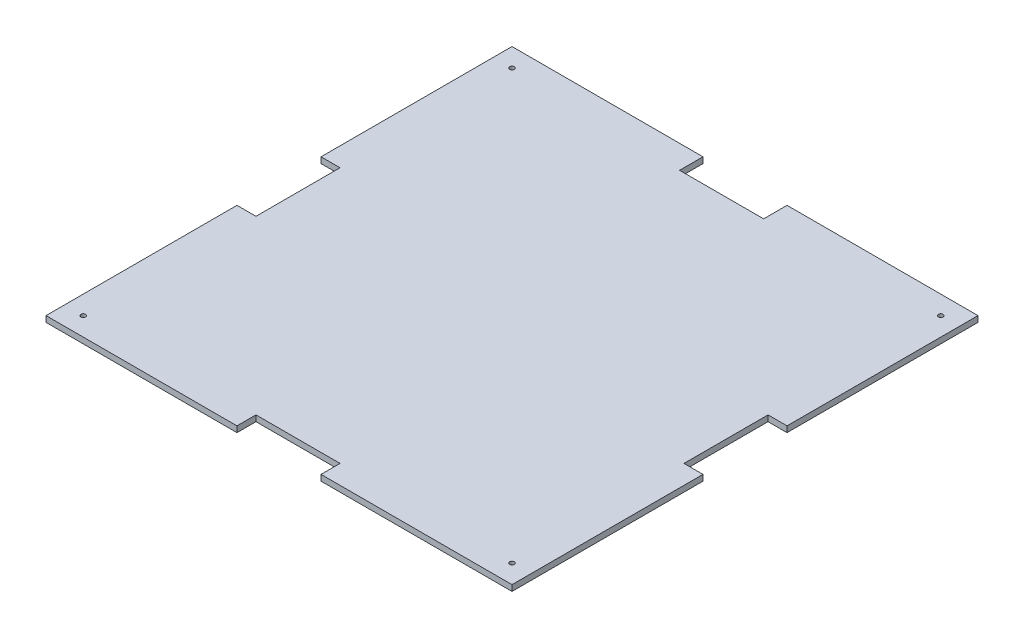
ISO-10303-21;
HEADER;
FILE_DESCRIPTION(('STEP AP214'),'2;1');
FILE_NAME('part.step','',(''),(''),'','','');
FILE_SCHEMA(('AUTOMOTIVE_DESIGN { 1 0 10303 214 1 1 1 1 }'));
ENDSEC;
DATA;
#1=APPLICATION_CONTEXT('core data for automotive mechanical design processes');
#2=APPLICATION_PROTOCOL_DEFINITION('international standard','automotive_design',2000,#1);
#3=PRODUCT_CONTEXT('',#1,'mechanical');
#4=PRODUCT('Part','Part','',(#3));
#5=PRODUCT_RELATED_PRODUCT_CATEGORY('part','',(#4));
#6=PRODUCT_DEFINITION_FORMATION('','',#4);
#7=PRODUCT_DEFINITION_CONTEXT('part definition',#1,'design');
#8=PRODUCT_DEFINITION('design','',#6,#7);
#9=PRODUCT_DEFINITION_SHAPE('','',#8);
#10=(LENGTH_UNIT() NAMED_UNIT(*) SI_UNIT(.MILLI.,.METRE.));
#11=(NAMED_UNIT(*) PLANE_ANGLE_UNIT() SI_UNIT($,.RADIAN.));
#12=(NAMED_UNIT(*) SI_UNIT($,.STERADIAN.) SOLID_ANGLE_UNIT());
#13=UNCERTAINTY_MEASURE_WITH_UNIT(LENGTH_MEASURE(1.E-05),#10,'distance_accuracy_value','');
#14=(GEOMETRIC_REPRESENTATION_CONTEXT(3) GLOBAL_UNCERTAINTY_ASSIGNED_CONTEXT((#13)) GLOBAL_UNIT_ASSIGNED_CONTEXT((#10,
#11,#12)) REPRESENTATION_CONTEXT('',''));
#15=CARTESIAN_POINT('',(0.,0.,0.));
#16=DIRECTION('',(0.,0.,1.));
#17=DIRECTION('',(1.,0.,0.));
#18=AXIS2_PLACEMENT_3D('',#15,#16,#17);
#19=CARTESIAN_POINT('',(0.,3.175,0.));
#20=DIRECTION('',(0.,-1.,0.));
#21=DIRECTION('',(0.,0.,-1.));
#22=AXIS2_PLACEMENT_3D('',#19,#20,#21);
#23=PLANE('',#22);
#24=CARTESIAN_POINT('',(115.,3.175,-115.));
#25=DIRECTION('',(0.,1.,0.));
#26=DIRECTION('',(0.,0.,1.));
#27=AXIS2_PLACEMENT_3D('',#24,#25,#26);
#28=CIRCLE('',#27,1.24999999999999);
#29=CARTESIAN_POINT('',(115.,3.175,-113.75));
#30=VERTEX_POINT('',#29);
#31=EDGE_CURVE('E418',#30,#30,#28,.T.);
#32=ORIENTED_EDGE('',*,*,#31,.F.);
#33=EDGE_LOOP('',(#32));
#34=FACE_BOUND('',#33,.T.);
#35=CARTESIAN_POINT('',(-115.,3.175,115.));
#36=DIRECTION('',(0.,1.,0.));
#37=DIRECTION('',(0.,0.,1.));
#38=AXIS2_PLACEMENT_3D('',#35,#36,#37);
#39=CIRCLE('',#38,1.24999999999999);
#40=CARTESIAN_POINT('',(-115.,3.175,116.25));
#41=VERTEX_POINT('',#40);
#42=EDGE_CURVE('E406',#41,#41,#39,.T.);
#43=ORIENTED_EDGE('',*,*,#42,.F.);
#44=EDGE_LOOP('',(#43));
#45=FACE_BOUND('',#44,.T.);
#46=CARTESIAN_POINT('',(-115.,3.175,-115.));
#47=DIRECTION('',(0.,1.,0.));
#48=DIRECTION('',(0.,0.,1.));
#49=AXIS2_PLACEMENT_3D('',#46,#47,#48);
#50=CIRCLE('',#49,1.24999999999999);
#51=CARTESIAN_POINT('',(-115.,3.175,-113.75));
#52=VERTEX_POINT('',#51);
#53=EDGE_CURVE('E400',#52,#52,#50,.T.);
#54=ORIENTED_EDGE('',*,*,#53,.F.);
#55=EDGE_LOOP('',(#54));
#56=FACE_BOUND('',#55,.T.);
#57=DIRECTION('',(-1.,0.,0.));
#58=VECTOR('',#57,1.);
#59=CARTESIAN_POINT('',(-125.,3.175,-125.));
#60=LINE('',#59,#58);
#61=CARTESIAN_POINT('',(125.,3.175,-125.));
#62=VERTEX_POINT('',#61);
#63=CARTESIAN_POINT('',(22.55,3.175,-125.));
#64=VERTEX_POINT('',#63);
#65=EDGE_CURVE('E262',#62,#64,#60,.T.);
#66=ORIENTED_EDGE('',*,*,#65,.T.);
#67=DIRECTION('',(0.,0.,-1.));
#68=VECTOR('',#67,1.);
#69=CARTESIAN_POINT('',(22.55,3.175,-137.55));
#70=LINE('',#69,#68);
#71=CARTESIAN_POINT('',(22.55,3.175,-112.45));
#72=VERTEX_POINT('',#71);
#73=EDGE_CURVE('E191',#72,#64,#70,.T.);
#74=ORIENTED_EDGE('',*,*,#73,.F.);
#75=DIRECTION('',(1.,0.,0.));
#76=VECTOR('',#75,1.);
#77=CARTESIAN_POINT('',(-22.55,3.175,-112.45));
#78=LINE('',#77,#76);
#79=CARTESIAN_POINT('',(-22.55,3.175,-112.45));
#80=VERTEX_POINT('',#79);
#81=EDGE_CURVE('E178',#80,#72,#78,.T.);
#82=ORIENTED_EDGE('',*,*,#81,.F.);
#83=DIRECTION('',(0.,0.,1.));
#84=VECTOR('',#83,1.);
#85=CARTESIAN_POINT('',(-22.55,3.175,-137.55));
#86=LINE('',#85,#84);
#87=CARTESIAN_POINT('',(-22.55,3.175,-125.));
#88=VERTEX_POINT('',#87);
#89=EDGE_CURVE('E185',#88,#80,#86,.T.);
#90=ORIENTED_EDGE('',*,*,#89,.F.);
#91=CARTESIAN_POINT('',(-125.,3.175,-125.));
#92=VERTEX_POINT('',#91);
#93=EDGE_CURVE('E260',#88,#92,#60,.T.);
#94=ORIENTED_EDGE('',*,*,#93,.T.);
#95=DIRECTION('',(0.,0.,1.));
#96=VECTOR('',#95,1.);
#97=CARTESIAN_POINT('',(-125.,3.175,125.));
#98=LINE('',#97,#96);
#99=CARTESIAN_POINT('',(-125.,3.175,-22.55));
#100=VERTEX_POINT('',#99);
#101=EDGE_CURVE('E265',#92,#100,#98,.T.);
#102=ORIENTED_EDGE('',*,*,#101,.T.);
#103=DIRECTION('',(-1.,0.,0.));
#104=VECTOR('',#103,1.);
#105=CARTESIAN_POINT('',(-114.810543342276,3.175,-22.55));
#106=LINE('',#105,#104);
#107=CARTESIAN_POINT('',(-114.810543342276,3.175,-22.55));
#108=VERTEX_POINT('',#107);
#109=EDGE_CURVE('E206',#108,#100,#106,.T.);
#110=ORIENTED_EDGE('',*,*,#109,.F.);
#111=DIRECTION('',(0.,0.,-1.));
#112=VECTOR('',#111,1.);
#113=CARTESIAN_POINT('',(-114.810543342276,3.175,22.55));
#114=LINE('',#113,#112);
#115=CARTESIAN_POINT('',(-114.810543342276,3.175,22.55));
#116=VERTEX_POINT('',#115);
#117=EDGE_CURVE('E202',#116,#108,#114,.T.);
#118=ORIENTED_EDGE('',*,*,#117,.F.);
#119=DIRECTION('',(1.,0.,0.));
#120=VECTOR('',#119,1.);
#121=CARTESIAN_POINT('',(-114.810543342276,3.175,22.55));
#122=LINE('',#121,#120);
#123=CARTESIAN_POINT('',(-125.,3.175,22.55));
#124=VERTEX_POINT('',#123);
#125=EDGE_CURVE('E200',#124,#116,#122,.T.);
#126=ORIENTED_EDGE('',*,*,#125,.F.);
#127=CARTESIAN_POINT('',(-125.,3.175,125.));
#128=VERTEX_POINT('',#127);
#129=EDGE_CURVE('E264',#124,#128,#98,.T.);
#130=ORIENTED_EDGE('',*,*,#129,.T.);
#131=DIRECTION('',(1.,0.,0.));
#132=VECTOR('',#131,1.);
#133=CARTESIAN_POINT('',(-125.,3.175,125.));
#134=LINE('',#133,#132);
#135=CARTESIAN_POINT('',(-22.55,3.175,125.));
#136=VERTEX_POINT('',#135);
#137=EDGE_CURVE('E269',#128,#136,#134,.T.);
#138=ORIENTED_EDGE('',*,*,#137,.T.);
#139=DIRECTION('',(0.,0.,1.));
#140=VECTOR('',#139,1.);
#141=CARTESIAN_POINT('',(-22.55,3.175,114.810543342276));
#142=LINE('',#141,#140);
#143=CARTESIAN_POINT('',(-22.55,3.175,114.810543342276));
#144=VERTEX_POINT('',#143);
#145=EDGE_CURVE('E223',#144,#136,#142,.T.);
#146=ORIENTED_EDGE('',*,*,#145,.F.);
#147=DIRECTION('',(-1.,0.,0.));
#148=VECTOR('',#147,1.);
#149=CARTESIAN_POINT('',(22.55,3.175,114.810543342276));
#150=LINE('',#149,#148);
#151=CARTESIAN_POINT('',(22.55,3.175,114.810543342276));
#152=VERTEX_POINT('',#151);
#153=EDGE_CURVE('E229',#152,#144,#150,.T.);
#154=ORIENTED_EDGE('',*,*,#153,.F.);
#155=DIRECTION('',(0.,0.,-1.));
#156=VECTOR('',#155,1.);
#157=CARTESIAN_POINT('',(22.55,3.175,114.810543342276));
#158=LINE('',#157,#156);
#159=CARTESIAN_POINT('',(22.55,3.175,125.));
#160=VERTEX_POINT('',#159);
#161=EDGE_CURVE('E225',#160,#152,#158,.T.);
#162=ORIENTED_EDGE('',*,*,#161,.F.);
#163=CARTESIAN_POINT('',(125.,3.175,125.));
#164=VERTEX_POINT('',#163);
#165=EDGE_CURVE('E268',#160,#164,#134,.T.);
#166=ORIENTED_EDGE('',*,*,#165,.T.);
#167=DIRECTION('',(0.,0.,-1.));
#168=VECTOR('',#167,1.);
#169=CARTESIAN_POINT('',(125.,3.175,125.));
#170=LINE('',#169,#168);
#171=CARTESIAN_POINT('',(125.,3.175,22.55));
#172=VERTEX_POINT('',#171);
#173=EDGE_CURVE('E257',#164,#172,#170,.T.);
#174=ORIENTED_EDGE('',*,*,#173,.T.);
#175=DIRECTION('',(1.,0.,0.));
#176=VECTOR('',#175,1.);
#177=CARTESIAN_POINT('',(114.810543342276,3.175,22.55));
#178=LINE('',#177,#176);
#179=CARTESIAN_POINT('',(114.810543342276,3.175,22.55));
#180=VERTEX_POINT('',#179);
#181=EDGE_CURVE('E218',#180,#172,#178,.T.);
#182=ORIENTED_EDGE('',*,*,#181,.F.);
#183=DIRECTION('',(0.,0.,1.));
#184=VECTOR('',#183,1.);
#185=CARTESIAN_POINT('',(114.810543342276,3.175,22.55));
#186=LINE('',#185,#184);
#187=CARTESIAN_POINT('',(114.810543342276,3.175,-22.55));
#188=VERTEX_POINT('',#187);
#189=EDGE_CURVE('E214',#188,#180,#186,.T.);
#190=ORIENTED_EDGE('',*,*,#189,.F.);
#191=DIRECTION('',(-1.,0.,0.));
#192=VECTOR('',#191,1.);
#193=CARTESIAN_POINT('',(114.810543342276,3.175,-22.55));
#194=LINE('',#193,#192);
#195=CARTESIAN_POINT('',(125.,3.175,-22.55));
#196=VERTEX_POINT('',#195);
#197=EDGE_CURVE('E211',#196,#188,#194,.T.);
#198=ORIENTED_EDGE('',*,*,#197,.F.);
#199=EDGE_CURVE('E261',#196,#62,#170,.T.);
#200=ORIENTED_EDGE('',*,*,#199,.T.);
#201=EDGE_LOOP('',(#66,#74,#82,#90,#94,#102,#110,#118,#126,#130,#138,#146,#154,#162,#166,#174,
#182,#190,#198,#200));
#202=FACE_BOUND('',#201,.T.);
#203=CARTESIAN_POINT('',(115.,3.175,115.));
#204=DIRECTION('',(0.,1.,0.));
#205=DIRECTION('',(0.,0.,1.));
#206=AXIS2_PLACEMENT_3D('',#203,#204,#205);
#207=CIRCLE('',#206,1.24999999999999);
#208=CARTESIAN_POINT('',(115.,3.175,116.25));
#209=VERTEX_POINT('',#208);
#210=EDGE_CURVE('E412',#209,#209,#207,.T.);
#211=ORIENTED_EDGE('',*,*,#210,.F.);
#212=EDGE_LOOP('',(#211));
#213=FACE_BOUND('',#212,.T.);
#214=ADVANCED_FACE('F40',(#34,#45,#56,#202,#213),#23,.F.);
#215=CARTESIAN_POINT('',(125.,3.175,125.));
#216=DIRECTION('',(-1.,0.,0.));
#217=DIRECTION('',(0.,0.,1.));
#218=AXIS2_PLACEMENT_3D('',#215,#216,#217);
#219=PLANE('',#218);
#220=DIRECTION('',(0.,0.,-1.));
#221=VECTOR('',#220,1.);
#222=CARTESIAN_POINT('',(125.,0.,125.));
#223=LINE('',#222,#221);
#224=CARTESIAN_POINT('',(125.,0.,125.));
#225=VERTEX_POINT('',#224);
#226=CARTESIAN_POINT('',(125.,0.,22.55));
#227=VERTEX_POINT('',#226);
#228=EDGE_CURVE('E273',#225,#227,#223,.T.);
#229=ORIENTED_EDGE('',*,*,#228,.T.);
#230=DIRECTION('',(0.,1.,0.));
#231=VECTOR('',#230,1.);
#232=CARTESIAN_POINT('',(125.,3.175,22.55));
#233=LINE('',#232,#231);
#234=EDGE_CURVE('E243',#227,#172,#233,.T.);
#235=ORIENTED_EDGE('',*,*,#234,.T.);
#236=ORIENTED_EDGE('',*,*,#173,.F.);
#237=DIRECTION('',(0.,-1.,0.));
#238=VECTOR('',#237,1.);
#239=CARTESIAN_POINT('',(125.,3.175,125.));
#240=LINE('',#239,#238);
#241=EDGE_CURVE('E272',#164,#225,#240,.T.);
#242=ORIENTED_EDGE('',*,*,#241,.T.);
#243=EDGE_LOOP('',(#229,#235,#236,#242));
#244=FACE_BOUND('',#243,.T.);
#245=ADVANCED_FACE('F373',(#244),#219,.F.);
#246=CARTESIAN_POINT('',(-125.,3.175,-125.));
#247=DIRECTION('',(0.,0.,1.));
#248=DIRECTION('',(1.,0.,0.));
#249=AXIS2_PLACEMENT_3D('',#246,#247,#248);
#250=PLANE('',#249);
#251=DIRECTION('',(-1.,0.,0.));
#252=VECTOR('',#251,1.);
#253=CARTESIAN_POINT('',(-125.,0.,-125.));
#254=LINE('',#253,#252);
#255=CARTESIAN_POINT('',(125.,0.,-125.));
#256=VERTEX_POINT('',#255);
#257=CARTESIAN_POINT('',(22.55,0.,-125.));
#258=VERTEX_POINT('',#257);
#259=EDGE_CURVE('E277',#256,#258,#254,.T.);
#260=ORIENTED_EDGE('',*,*,#259,.T.);
#261=DIRECTION('',(0.,1.,0.));
#262=VECTOR('',#261,1.);
#263=CARTESIAN_POINT('',(22.55,3.175,-125.));
#264=LINE('',#263,#262);
#265=EDGE_CURVE('E253',#258,#64,#264,.T.);
#266=ORIENTED_EDGE('',*,*,#265,.T.);
#267=ORIENTED_EDGE('',*,*,#65,.F.);
#268=DIRECTION('',(0.,-1.,0.));
#269=VECTOR('',#268,1.);
#270=CARTESIAN_POINT('',(125.,3.175,-125.));
#271=LINE('',#270,#269);
#272=EDGE_CURVE('E296',#62,#256,#271,.T.);
#273=ORIENTED_EDGE('',*,*,#272,.T.);
#274=EDGE_LOOP('',(#260,#266,#267,#273));
#275=FACE_BOUND('',#274,.T.);
#276=ADVANCED_FACE('F394',(#275),#250,.F.);
#277=CARTESIAN_POINT('',(-125.,3.175,125.));
#278=DIRECTION('',(1.,0.,0.));
#279=DIRECTION('',(0.,0.,-1.));
#280=AXIS2_PLACEMENT_3D('',#277,#278,#279);
#281=PLANE('',#280);
#282=DIRECTION('',(0.,0.,1.));
#283=VECTOR('',#282,1.);
#284=CARTESIAN_POINT('',(-125.,0.,125.));
#285=LINE('',#284,#283);
#286=CARTESIAN_POINT('',(-125.,0.,-125.));
#287=VERTEX_POINT('',#286);
#288=CARTESIAN_POINT('',(-125.,0.,-22.55));
#289=VERTEX_POINT('',#288);
#290=EDGE_CURVE('E281',#287,#289,#285,.T.);
#291=ORIENTED_EDGE('',*,*,#290,.T.);
#292=DIRECTION('',(0.,1.,0.));
#293=VECTOR('',#292,1.);
#294=CARTESIAN_POINT('',(-125.,3.175,-22.55));
#295=LINE('',#294,#293);
#296=EDGE_CURVE('E249',#289,#100,#295,.T.);
#297=ORIENTED_EDGE('',*,*,#296,.T.);
#298=ORIENTED_EDGE('',*,*,#101,.F.);
#299=DIRECTION('',(0.,-1.,0.));
#300=VECTOR('',#299,1.);
#301=CARTESIAN_POINT('',(-125.,3.175,-125.));
#302=LINE('',#301,#300);
#303=EDGE_CURVE('E293',#92,#287,#302,.T.);
#304=ORIENTED_EDGE('',*,*,#303,.T.);
#305=EDGE_LOOP('',(#291,#297,#298,#304));
#306=FACE_BOUND('',#305,.T.);
#307=ADVANCED_FACE('F331',(#306),#281,.F.);
#308=CARTESIAN_POINT('',(-125.,3.175,125.));
#309=DIRECTION('',(0.,0.,-1.));
#310=DIRECTION('',(-1.,0.,0.));
#311=AXIS2_PLACEMENT_3D('',#308,#309,#310);
#312=PLANE('',#311);
#313=DIRECTION('',(1.,0.,0.));
#314=VECTOR('',#313,1.);
#315=CARTESIAN_POINT('',(-125.,0.,125.));
#316=LINE('',#315,#314);
#317=CARTESIAN_POINT('',(-125.,0.,125.));
#318=VERTEX_POINT('',#317);
#319=CARTESIAN_POINT('',(-22.55,0.,125.));
#320=VERTEX_POINT('',#319);
#321=EDGE_CURVE('E285',#318,#320,#316,.T.);
#322=ORIENTED_EDGE('',*,*,#321,.T.);
#323=DIRECTION('',(0.,1.,0.));
#324=VECTOR('',#323,1.);
#325=CARTESIAN_POINT('',(-22.55,3.175,125.));
#326=LINE('',#325,#324);
#327=EDGE_CURVE('E237',#320,#136,#326,.T.);
#328=ORIENTED_EDGE('',*,*,#327,.T.);
#329=ORIENTED_EDGE('',*,*,#137,.F.);
#330=DIRECTION('',(0.,-1.,0.));
#331=VECTOR('',#330,1.);
#332=CARTESIAN_POINT('',(-125.,3.175,125.));
#333=LINE('',#332,#331);
#334=EDGE_CURVE('E290',#128,#318,#333,.T.);
#335=ORIENTED_EDGE('',*,*,#334,.T.);
#336=EDGE_LOOP('',(#322,#328,#329,#335));
#337=FACE_BOUND('',#336,.T.);
#338=ADVANCED_FACE('F351',(#337),#312,.F.);
#339=ORIENTED_EDGE('',*,*,#199,.F.);
#340=DIRECTION('',(0.,-1.,0.));
#341=VECTOR('',#340,1.);
#342=CARTESIAN_POINT('',(125.,3.175,-22.55));
#343=LINE('',#342,#341);
#344=CARTESIAN_POINT('',(125.,0.,-22.55));
#345=VERTEX_POINT('',#344);
#346=EDGE_CURVE('E240',#196,#345,#343,.T.);
#347=ORIENTED_EDGE('',*,*,#346,.T.);
#348=EDGE_CURVE('E256',#345,#256,#223,.T.);
#349=ORIENTED_EDGE('',*,*,#348,.T.);
#350=ORIENTED_EDGE('',*,*,#272,.F.);
#351=EDGE_LOOP('',(#339,#347,#349,#350));
#352=FACE_BOUND('',#351,.T.);
#353=ADVANCED_FACE('F42',(#352),#219,.F.);
#354=ORIENTED_EDGE('',*,*,#93,.F.);
#355=DIRECTION('',(0.,-1.,0.));
#356=VECTOR('',#355,1.);
#357=CARTESIAN_POINT('',(-22.55,3.175,-125.));
#358=LINE('',#357,#356);
#359=CARTESIAN_POINT('',(-22.55,0.,-125.));
#360=VERTEX_POINT('',#359);
#361=EDGE_CURVE('E188',#88,#360,#358,.T.);
#362=ORIENTED_EDGE('',*,*,#361,.T.);
#363=EDGE_CURVE('E276',#360,#287,#254,.T.);
#364=ORIENTED_EDGE('',*,*,#363,.T.);
#365=ORIENTED_EDGE('',*,*,#303,.F.);
#366=EDGE_LOOP('',(#354,#362,#364,#365));
#367=FACE_BOUND('',#366,.T.);
#368=ADVANCED_FACE('F323',(#367),#250,.F.);
#369=ORIENTED_EDGE('',*,*,#129,.F.);
#370=DIRECTION('',(0.,-1.,0.));
#371=VECTOR('',#370,1.);
#372=CARTESIAN_POINT('',(-125.,3.175,22.55));
#373=LINE('',#372,#371);
#374=CARTESIAN_POINT('',(-125.,0.,22.55));
#375=VERTEX_POINT('',#374);
#376=EDGE_CURVE('E246',#124,#375,#373,.T.);
#377=ORIENTED_EDGE('',*,*,#376,.T.);
#378=EDGE_CURVE('E280',#375,#318,#285,.T.);
#379=ORIENTED_EDGE('',*,*,#378,.T.);
#380=ORIENTED_EDGE('',*,*,#334,.F.);
#381=EDGE_LOOP('',(#369,#377,#379,#380));
#382=FACE_BOUND('',#381,.T.);
#383=ADVANCED_FACE('F346',(#382),#281,.F.);
#384=ORIENTED_EDGE('',*,*,#165,.F.);
#385=DIRECTION('',(0.,-1.,0.));
#386=VECTOR('',#385,1.);
#387=CARTESIAN_POINT('',(22.55,3.175,125.));
#388=LINE('',#387,#386);
#389=CARTESIAN_POINT('',(22.55,0.,125.));
#390=VERTEX_POINT('',#389);
#391=EDGE_CURVE('E198',#160,#390,#388,.T.);
#392=ORIENTED_EDGE('',*,*,#391,.T.);
#393=EDGE_CURVE('E284',#390,#225,#316,.T.);
#394=ORIENTED_EDGE('',*,*,#393,.T.);
#395=ORIENTED_EDGE('',*,*,#241,.F.);
#396=EDGE_LOOP('',(#384,#392,#394,#395));
#397=FACE_BOUND('',#396,.T.);
#398=ADVANCED_FACE('F368',(#397),#312,.F.);
#399=CARTESIAN_POINT('',(0.,0.,0.));
#400=DIRECTION('',(0.,-1.,0.));
#401=DIRECTION('',(0.,0.,-1.));
#402=AXIS2_PLACEMENT_3D('',#399,#400,#401);
#403=PLANE('',#402);
#404=CARTESIAN_POINT('',(115.,0.,-115.));
#405=DIRECTION('',(0.,1.,0.));
#406=DIRECTION('',(0.,0.,1.));
#407=AXIS2_PLACEMENT_3D('',#404,#405,#406);
#408=CIRCLE('',#407,1.25);
#409=CARTESIAN_POINT('',(115.,0.,-113.75));
#410=VERTEX_POINT('',#409);
#411=EDGE_CURVE('E415',#410,#410,#408,.T.);
#412=ORIENTED_EDGE('',*,*,#411,.T.);
#413=EDGE_LOOP('',(#412));
#414=FACE_BOUND('',#413,.T.);
#415=CARTESIAN_POINT('',(115.,0.,115.));
#416=DIRECTION('',(0.,1.,0.));
#417=DIRECTION('',(0.,0.,1.));
#418=AXIS2_PLACEMENT_3D('',#415,#416,#417);
#419=CIRCLE('',#418,1.25);
#420=CARTESIAN_POINT('',(115.,0.,116.25));
#421=VERTEX_POINT('',#420);
#422=EDGE_CURVE('E409',#421,#421,#419,.T.);
#423=ORIENTED_EDGE('',*,*,#422,.T.);
#424=EDGE_LOOP('',(#423));
#425=FACE_BOUND('',#424,.T.);
#426=CARTESIAN_POINT('',(-115.,0.,115.));
#427=DIRECTION('',(0.,1.,0.));
#428=DIRECTION('',(0.,0.,1.));
#429=AXIS2_PLACEMENT_3D('',#426,#427,#428);
#430=CIRCLE('',#429,1.25);
#431=CARTESIAN_POINT('',(-115.,0.,116.25));
#432=VERTEX_POINT('',#431);
#433=EDGE_CURVE('E403',#432,#432,#430,.T.);
#434=ORIENTED_EDGE('',*,*,#433,.T.);
#435=EDGE_LOOP('',(#434));
#436=FACE_BOUND('',#435,.T.);
#437=CARTESIAN_POINT('',(-115.,0.,-115.));
#438=DIRECTION('',(0.,1.,0.));
#439=DIRECTION('',(0.,0.,1.));
#440=AXIS2_PLACEMENT_3D('',#437,#438,#439);
#441=CIRCLE('',#440,1.25);
#442=CARTESIAN_POINT('',(-115.,0.,-113.75));
#443=VERTEX_POINT('',#442);
#444=EDGE_CURVE('E226',#443,#443,#441,.T.);
#445=ORIENTED_EDGE('',*,*,#444,.T.);
#446=EDGE_LOOP('',(#445));
#447=FACE_BOUND('',#446,.T.);
#448=DIRECTION('',(0.,0.,1.));
#449=VECTOR('',#448,1.);
#450=CARTESIAN_POINT('',(22.55,0.,0.));
#451=LINE('',#450,#449);
#452=CARTESIAN_POINT('',(22.55,0.,-112.45));
#453=VERTEX_POINT('',#452);
#454=EDGE_CURVE('E11',#258,#453,#451,.T.);
#455=ORIENTED_EDGE('',*,*,#454,.F.);
#456=ORIENTED_EDGE('',*,*,#259,.F.);
#457=ORIENTED_EDGE('',*,*,#348,.F.);
#458=DIRECTION('',(1.,0.,0.));
#459=VECTOR('',#458,1.);
#460=CARTESIAN_POINT('',(0.,0.,-22.55));
#461=LINE('',#460,#459);
#462=CARTESIAN_POINT('',(114.810543342276,0.,-22.55));
#463=VERTEX_POINT('',#462);
#464=EDGE_CURVE('E306',#463,#345,#461,.T.);
#465=ORIENTED_EDGE('',*,*,#464,.F.);
#466=DIRECTION('',(0.,0.,-1.));
#467=VECTOR('',#466,1.);
#468=CARTESIAN_POINT('',(114.810543342276,0.,0.));
#469=LINE('',#468,#467);
#470=CARTESIAN_POINT('',(114.810543342276,0.,22.55));
#471=VERTEX_POINT('',#470);
#472=EDGE_CURVE('E308',#471,#463,#469,.T.);
#473=ORIENTED_EDGE('',*,*,#472,.F.);
#474=DIRECTION('',(-1.,0.,0.));
#475=VECTOR('',#474,1.);
#476=CARTESIAN_POINT('',(0.,0.,22.55));
#477=LINE('',#476,#475);
#478=EDGE_CURVE('E311',#227,#471,#477,.T.);
#479=ORIENTED_EDGE('',*,*,#478,.F.);
#480=ORIENTED_EDGE('',*,*,#228,.F.);
#481=ORIENTED_EDGE('',*,*,#393,.F.);
#482=DIRECTION('',(0.,0.,1.));
#483=VECTOR('',#482,1.);
#484=CARTESIAN_POINT('',(22.55,0.,0.));
#485=LINE('',#484,#483);
#486=CARTESIAN_POINT('',(22.55,0.,114.810543342276));
#487=VERTEX_POINT('',#486);
#488=EDGE_CURVE('E299',#487,#390,#485,.T.);
#489=ORIENTED_EDGE('',*,*,#488,.F.);
#490=DIRECTION('',(1.,0.,0.));
#491=VECTOR('',#490,1.);
#492=CARTESIAN_POINT('',(0.,0.,114.810543342276));
#493=LINE('',#492,#491);
#494=CARTESIAN_POINT('',(-22.55,0.,114.810543342276));
#495=VERTEX_POINT('',#494);
#496=EDGE_CURVE('E301',#495,#487,#493,.T.);
#497=ORIENTED_EDGE('',*,*,#496,.F.);
#498=DIRECTION('',(0.,0.,-1.));
#499=VECTOR('',#498,1.);
#500=CARTESIAN_POINT('',(-22.55,0.,0.));
#501=LINE('',#500,#499);
#502=EDGE_CURVE('E304',#320,#495,#501,.T.);
#503=ORIENTED_EDGE('',*,*,#502,.F.);
#504=ORIENTED_EDGE('',*,*,#321,.F.);
#505=ORIENTED_EDGE('',*,*,#378,.F.);
#506=DIRECTION('',(-1.,0.,0.));
#507=VECTOR('',#506,1.);
#508=CARTESIAN_POINT('',(0.,0.,22.55));
#509=LINE('',#508,#507);
#510=CARTESIAN_POINT('',(-114.810543342276,0.,22.55));
#511=VERTEX_POINT('',#510);
#512=EDGE_CURVE('E313',#511,#375,#509,.T.);
#513=ORIENTED_EDGE('',*,*,#512,.F.);
#514=DIRECTION('',(0.,0.,1.));
#515=VECTOR('',#514,1.);
#516=CARTESIAN_POINT('',(-114.810543342276,0.,0.));
#517=LINE('',#516,#515);
#518=CARTESIAN_POINT('',(-114.810543342276,0.,-22.55));
#519=VERTEX_POINT('',#518);
#520=EDGE_CURVE('E315',#519,#511,#517,.T.);
#521=ORIENTED_EDGE('',*,*,#520,.F.);
#522=DIRECTION('',(1.,0.,0.));
#523=VECTOR('',#522,1.);
#524=CARTESIAN_POINT('',(0.,0.,-22.55));
#525=LINE('',#524,#523);
#526=EDGE_CURVE('E317',#289,#519,#525,.T.);
#527=ORIENTED_EDGE('',*,*,#526,.F.);
#528=ORIENTED_EDGE('',*,*,#290,.F.);
#529=ORIENTED_EDGE('',*,*,#363,.F.);
#530=DIRECTION('',(0.,0.,-1.));
#531=VECTOR('',#530,1.);
#532=CARTESIAN_POINT('',(-22.55,0.,0.));
#533=LINE('',#532,#531);
#534=CARTESIAN_POINT('',(-22.55,0.,-112.45));
#535=VERTEX_POINT('',#534);
#536=EDGE_CURVE('E319',#535,#360,#533,.T.);
#537=ORIENTED_EDGE('',*,*,#536,.F.);
#538=DIRECTION('',(-1.,0.,0.));
#539=VECTOR('',#538,1.);
#540=CARTESIAN_POINT('',(0.,0.,-112.45));
#541=LINE('',#540,#539);
#542=EDGE_CURVE('E48',#453,#535,#541,.T.);
#543=ORIENTED_EDGE('',*,*,#542,.F.);
#544=EDGE_LOOP('',(#455,#456,#457,#465,#473,#479,#480,#481,#489,#497,#503,#504,#505,#513,#521,
#527,#528,#529,#537,#543));
#545=FACE_BOUND('',#544,.T.);
#546=ADVANCED_FACE('F327',(#414,#425,#436,#447,#545),#403,.T.);
#547=CARTESIAN_POINT('',(-22.55,-6.825,114.810543342276));
#548=DIRECTION('',(-1.,0.,0.));
#549=DIRECTION('',(0.,0.,1.));
#550=AXIS2_PLACEMENT_3D('',#547,#548,#549);
#551=PLANE('',#550);
#552=ORIENTED_EDGE('',*,*,#502,.T.);
#553=DIRECTION('',(0.,1.,0.));
#554=VECTOR('',#553,1.);
#555=CARTESIAN_POINT('',(-22.55,-6.825,114.810543342276));
#556=LINE('',#555,#554);
#557=EDGE_CURVE('E215',#495,#144,#556,.T.);
#558=ORIENTED_EDGE('',*,*,#557,.T.);
#559=ORIENTED_EDGE('',*,*,#145,.T.);
#560=ORIENTED_EDGE('',*,*,#327,.F.);
#561=EDGE_LOOP('',(#552,#558,#559,#560));
#562=FACE_BOUND('',#561,.T.);
#563=ADVANCED_FACE('F356',(#562),#551,.F.);
#564=CARTESIAN_POINT('',(22.55,-6.825,114.810543342276));
#565=DIRECTION('',(1.,0.,0.));
#566=DIRECTION('',(0.,0.,-1.));
#567=AXIS2_PLACEMENT_3D('',#564,#565,#566);
#568=PLANE('',#567);
#569=ORIENTED_EDGE('',*,*,#161,.T.);
#570=DIRECTION('',(0.,1.,0.));
#571=VECTOR('',#570,1.);
#572=CARTESIAN_POINT('',(22.55,-6.825,114.810543342276));
#573=LINE('',#572,#571);
#574=EDGE_CURVE('E232',#487,#152,#573,.T.);
#575=ORIENTED_EDGE('',*,*,#574,.F.);
#576=ORIENTED_EDGE('',*,*,#488,.T.);
#577=ORIENTED_EDGE('',*,*,#391,.F.);
#578=EDGE_LOOP('',(#569,#575,#576,#577));
#579=FACE_BOUND('',#578,.T.);
#580=ADVANCED_FACE('F364',(#579),#568,.F.);
#581=CARTESIAN_POINT('',(22.55,-6.825,114.810543342276));
#582=DIRECTION('',(0.,0.,-1.));
#583=DIRECTION('',(-1.,0.,0.));
#584=AXIS2_PLACEMENT_3D('',#581,#582,#583);
#585=PLANE('',#584);
#586=ORIENTED_EDGE('',*,*,#496,.T.);
#587=ORIENTED_EDGE('',*,*,#574,.T.);
#588=ORIENTED_EDGE('',*,*,#153,.T.);
#589=ORIENTED_EDGE('',*,*,#557,.F.);
#590=EDGE_LOOP('',(#586,#587,#588,#589));
#591=FACE_BOUND('',#590,.T.);
#592=ADVANCED_FACE('F361',(#591),#585,.F.);
#593=CARTESIAN_POINT('',(114.810543342276,-6.825,22.55));
#594=DIRECTION('',(0.,0.,1.));
#595=DIRECTION('',(1.,0.,0.));
#596=AXIS2_PLACEMENT_3D('',#593,#594,#595);
#597=PLANE('',#596);
#598=ORIENTED_EDGE('',*,*,#478,.T.);
#599=DIRECTION('',(0.,1.,0.));
#600=VECTOR('',#599,1.);
#601=CARTESIAN_POINT('',(114.810543342276,-6.825,22.55));
#602=LINE('',#601,#600);
#603=EDGE_CURVE('E203',#471,#180,#602,.T.);
#604=ORIENTED_EDGE('',*,*,#603,.T.);
#605=ORIENTED_EDGE('',*,*,#181,.T.);
#606=ORIENTED_EDGE('',*,*,#234,.F.);
#607=EDGE_LOOP('',(#598,#604,#605,#606));
#608=FACE_BOUND('',#607,.T.);
#609=ADVANCED_FACE('F378',(#608),#597,.F.);
#610=CARTESIAN_POINT('',(114.810543342276,-6.825,-22.55));
#611=DIRECTION('',(0.,0.,-1.));
#612=DIRECTION('',(-1.,0.,0.));
#613=AXIS2_PLACEMENT_3D('',#610,#611,#612);
#614=PLANE('',#613);
#615=ORIENTED_EDGE('',*,*,#197,.T.);
#616=DIRECTION('',(0.,1.,0.));
#617=VECTOR('',#616,1.);
#618=CARTESIAN_POINT('',(114.810543342276,-6.825,-22.55));
#619=LINE('',#618,#617);
#620=EDGE_CURVE('E220',#463,#188,#619,.T.);
#621=ORIENTED_EDGE('',*,*,#620,.F.);
#622=ORIENTED_EDGE('',*,*,#464,.T.);
#623=ORIENTED_EDGE('',*,*,#346,.F.);
#624=EDGE_LOOP('',(#615,#621,#622,#623));
#625=FACE_BOUND('',#624,.T.);
#626=ADVANCED_FACE('F386',(#625),#614,.F.);
#627=CARTESIAN_POINT('',(114.810543342276,-6.825,22.55));
#628=DIRECTION('',(-1.,0.,0.));
#629=DIRECTION('',(0.,0.,1.));
#630=AXIS2_PLACEMENT_3D('',#627,#628,#629);
#631=PLANE('',#630);
#632=ORIENTED_EDGE('',*,*,#472,.T.);
#633=ORIENTED_EDGE('',*,*,#620,.T.);
#634=ORIENTED_EDGE('',*,*,#189,.T.);
#635=ORIENTED_EDGE('',*,*,#603,.F.);
#636=EDGE_LOOP('',(#632,#633,#634,#635));
#637=FACE_BOUND('',#636,.T.);
#638=ADVANCED_FACE('F383',(#637),#631,.F.);
#639=CARTESIAN_POINT('',(-114.810543342276,-6.825,-22.55));
#640=DIRECTION('',(0.,0.,-1.));
#641=DIRECTION('',(-1.,0.,0.));
#642=AXIS2_PLACEMENT_3D('',#639,#640,#641);
#643=PLANE('',#642);
#644=ORIENTED_EDGE('',*,*,#526,.T.);
#645=DIRECTION('',(0.,1.,0.));
#646=VECTOR('',#645,1.);
#647=CARTESIAN_POINT('',(-114.810543342276,-6.825,-22.55));
#648=LINE('',#647,#646);
#649=EDGE_CURVE('E208',#519,#108,#648,.T.);
#650=ORIENTED_EDGE('',*,*,#649,.T.);
#651=ORIENTED_EDGE('',*,*,#109,.T.);
#652=ORIENTED_EDGE('',*,*,#296,.F.);
#653=EDGE_LOOP('',(#644,#650,#651,#652));
#654=FACE_BOUND('',#653,.T.);
#655=ADVANCED_FACE('F337',(#654),#643,.F.);
#656=CARTESIAN_POINT('',(-114.810543342276,-6.825,22.55));
#657=DIRECTION('',(0.,0.,1.));
#658=DIRECTION('',(1.,0.,0.));
#659=AXIS2_PLACEMENT_3D('',#656,#657,#658);
#660=PLANE('',#659);
#661=ORIENTED_EDGE('',*,*,#125,.T.);
#662=DIRECTION('',(0.,1.,0.));
#663=VECTOR('',#662,1.);
#664=CARTESIAN_POINT('',(-114.810543342276,-6.825,22.55));
#665=LINE('',#664,#663);
#666=EDGE_CURVE('E63',#511,#116,#665,.T.);
#667=ORIENTED_EDGE('',*,*,#666,.F.);
#668=ORIENTED_EDGE('',*,*,#512,.T.);
#669=ORIENTED_EDGE('',*,*,#376,.F.);
#670=EDGE_LOOP('',(#661,#667,#668,#669));
#671=FACE_BOUND('',#670,.T.);
#672=ADVANCED_FACE('F342',(#671),#660,.F.);
#673=CARTESIAN_POINT('',(-114.810543342276,-6.825,22.55));
#674=DIRECTION('',(1.,0.,0.));
#675=DIRECTION('',(0.,0.,-1.));
#676=AXIS2_PLACEMENT_3D('',#673,#674,#675);
#677=PLANE('',#676);
#678=ORIENTED_EDGE('',*,*,#520,.T.);
#679=ORIENTED_EDGE('',*,*,#666,.T.);
#680=ORIENTED_EDGE('',*,*,#117,.T.);
#681=ORIENTED_EDGE('',*,*,#649,.F.);
#682=EDGE_LOOP('',(#678,#679,#680,#681));
#683=FACE_BOUND('',#682,.T.);
#684=ADVANCED_FACE('F340',(#683),#677,.F.);
#685=CARTESIAN_POINT('',(22.55,-6.825,-137.55));
#686=DIRECTION('',(1.,0.,0.));
#687=DIRECTION('',(0.,0.,-1.));
#688=AXIS2_PLACEMENT_3D('',#685,#686,#687);
#689=PLANE('',#688);
#690=ORIENTED_EDGE('',*,*,#454,.T.);
#691=DIRECTION('',(0.,1.,0.));
#692=VECTOR('',#691,1.);
#693=CARTESIAN_POINT('',(22.55,-6.825,-112.45));
#694=LINE('',#693,#692);
#695=EDGE_CURVE('E182',#453,#72,#694,.T.);
#696=ORIENTED_EDGE('',*,*,#695,.T.);
#697=ORIENTED_EDGE('',*,*,#73,.T.);
#698=ORIENTED_EDGE('',*,*,#265,.F.);
#699=EDGE_LOOP('',(#690,#696,#697,#698));
#700=FACE_BOUND('',#699,.T.);
#701=ADVANCED_FACE('F396',(#700),#689,.F.);
#702=CARTESIAN_POINT('',(-22.55,-6.825,-137.55));
#703=DIRECTION('',(-1.,0.,0.));
#704=DIRECTION('',(0.,0.,1.));
#705=AXIS2_PLACEMENT_3D('',#702,#703,#704);
#706=PLANE('',#705);
#707=ORIENTED_EDGE('',*,*,#89,.T.);
#708=DIRECTION('',(0.,1.,0.));
#709=VECTOR('',#708,1.);
#710=CARTESIAN_POINT('',(-22.55,-6.825,-112.45));
#711=LINE('',#710,#709);
#712=EDGE_CURVE('E55',#535,#80,#711,.T.);
#713=ORIENTED_EDGE('',*,*,#712,.F.);
#714=ORIENTED_EDGE('',*,*,#536,.T.);
#715=ORIENTED_EDGE('',*,*,#361,.F.);
#716=EDGE_LOOP('',(#707,#713,#714,#715));
#717=FACE_BOUND('',#716,.T.);
#718=ADVANCED_FACE('F186',(#717),#706,.F.);
#719=CARTESIAN_POINT('',(-22.55,-6.825,-112.45));
#720=DIRECTION('',(0.,0.,1.));
#721=DIRECTION('',(1.,0.,0.));
#722=AXIS2_PLACEMENT_3D('',#719,#720,#721);
#723=PLANE('',#722);
#724=ORIENTED_EDGE('',*,*,#542,.T.);
#725=ORIENTED_EDGE('',*,*,#712,.T.);
#726=ORIENTED_EDGE('',*,*,#81,.T.);
#727=ORIENTED_EDGE('',*,*,#695,.F.);
#728=EDGE_LOOP('',(#724,#725,#726,#727));
#729=FACE_BOUND('',#728,.T.);
#730=ADVANCED_FACE('F175',(#729),#723,.F.);
#731=CARTESIAN_POINT('',(-115.,3.175,-115.));
#732=DIRECTION('',(0.,1.,0.));
#733=DIRECTION('',(0.,0.,1.));
#734=AXIS2_PLACEMENT_3D('',#731,#732,#733);
#735=CYLINDRICAL_SURFACE('',#734,1.24999999999999);
#736=ORIENTED_EDGE('',*,*,#444,.F.);
#737=EDGE_LOOP('',(#736));
#738=FACE_BOUND('',#737,.T.);
#739=ORIENTED_EDGE('',*,*,#53,.T.);
#740=EDGE_LOOP('',(#739));
#741=FACE_BOUND('',#740,.T.);
#742=ADVANCED_FACE('F431',(#738,#741),#735,.F.);
#743=CARTESIAN_POINT('',(-115.,3.175,115.));
#744=DIRECTION('',(0.,1.,0.));
#745=DIRECTION('',(0.,0.,1.));
#746=AXIS2_PLACEMENT_3D('',#743,#744,#745);
#747=CYLINDRICAL_SURFACE('',#746,1.24999999999999);
#748=ORIENTED_EDGE('',*,*,#433,.F.);
#749=EDGE_LOOP('',(#748));
#750=FACE_BOUND('',#749,.T.);
#751=ORIENTED_EDGE('',*,*,#42,.T.);
#752=EDGE_LOOP('',(#751));
#753=FACE_BOUND('',#752,.T.);
#754=ADVANCED_FACE('F433',(#750,#753),#747,.F.);
#755=CARTESIAN_POINT('',(115.,3.175,115.));
#756=DIRECTION('',(0.,1.,0.));
#757=DIRECTION('',(0.,0.,1.));
#758=AXIS2_PLACEMENT_3D('',#755,#756,#757);
#759=CYLINDRICAL_SURFACE('',#758,1.24999999999999);
#760=ORIENTED_EDGE('',*,*,#422,.F.);
#761=EDGE_LOOP('',(#760));
#762=FACE_BOUND('',#761,.T.);
#763=ORIENTED_EDGE('',*,*,#210,.T.);
#764=EDGE_LOOP('',(#763));
#765=FACE_BOUND('',#764,.T.);
#766=ADVANCED_FACE('F441',(#762,#765),#759,.F.);
#767=CARTESIAN_POINT('',(115.,3.175,-115.));
#768=DIRECTION('',(0.,1.,0.));
#769=DIRECTION('',(0.,0.,1.));
#770=AXIS2_PLACEMENT_3D('',#767,#768,#769);
#771=CYLINDRICAL_SURFACE('',#770,1.24999999999999);
#772=ORIENTED_EDGE('',*,*,#411,.F.);
#773=EDGE_LOOP('',(#772));
#774=FACE_BOUND('',#773,.T.);
#775=ORIENTED_EDGE('',*,*,#31,.T.);
#776=EDGE_LOOP('',(#775));
#777=FACE_BOUND('',#776,.T.);
#778=ADVANCED_FACE('F422',(#774,#777),#771,.F.);
#779=CLOSED_SHELL('',(#214,#245,#276,#307,#338,#353,#368,#383,#398,#546,#563,#580,#592,#609,
#626,#638,#655,#672,#684,#701,#718,#730,#742,#754,#766,#778));
#780=MANIFOLD_SOLID_BREP('B2',#779);
#781=ADVANCED_BREP_SHAPE_REPRESENTATION('',(#18,#780),#14);
#782=SHAPE_DEFINITION_REPRESENTATION(#9,#781);
ENDSEC;
END-ISO-10303-21;
